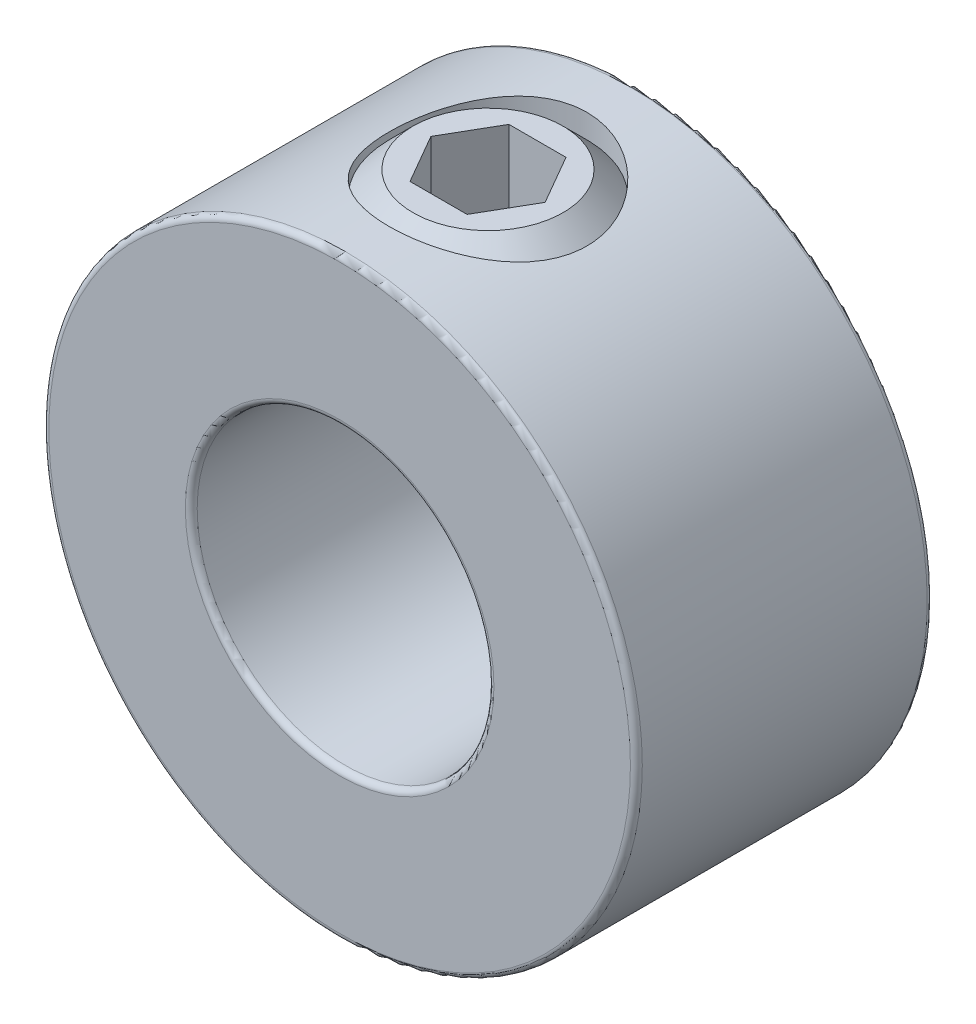
ISO-10303-21;
HEADER;
FILE_DESCRIPTION(('STEP AP214'),'2;1');
FILE_NAME('part.step','',(''),(''),'','','');
FILE_SCHEMA(('AUTOMOTIVE_DESIGN { 1 0 10303 214 1 1 1 1 }'));
ENDSEC;
DATA;
#1=APPLICATION_CONTEXT('core data for automotive mechanical design processes');
#2=APPLICATION_PROTOCOL_DEFINITION('international standard','automotive_design',2000,#1);
#3=PRODUCT_CONTEXT('',#1,'mechanical');
#4=PRODUCT('Part','Part','',(#3));
#5=PRODUCT_RELATED_PRODUCT_CATEGORY('part','',(#4));
#6=PRODUCT_DEFINITION_FORMATION('','',#4);
#7=PRODUCT_DEFINITION_CONTEXT('part definition',#1,'design');
#8=PRODUCT_DEFINITION('design','',#6,#7);
#9=PRODUCT_DEFINITION_SHAPE('','',#8);
#10=(LENGTH_UNIT() NAMED_UNIT(*) SI_UNIT(.MILLI.,.METRE.));
#11=(NAMED_UNIT(*) PLANE_ANGLE_UNIT() SI_UNIT($,.RADIAN.));
#12=(NAMED_UNIT(*) SI_UNIT($,.STERADIAN.) SOLID_ANGLE_UNIT());
#13=UNCERTAINTY_MEASURE_WITH_UNIT(LENGTH_MEASURE(1.E-05),#10,'distance_accuracy_value','');
#14=(GEOMETRIC_REPRESENTATION_CONTEXT(3) GLOBAL_UNCERTAINTY_ASSIGNED_CONTEXT((#13)) GLOBAL_UNIT_ASSIGNED_CONTEXT((#10,
#11,#12)) REPRESENTATION_CONTEXT('',''));
#15=CARTESIAN_POINT('',(0.,0.,0.));
#16=DIRECTION('',(0.,0.,1.));
#17=DIRECTION('',(1.,0.,0.));
#18=AXIS2_PLACEMENT_3D('',#15,#16,#17);
#19=CARTESIAN_POINT('',(0.,9.525,0.));
#20=DIRECTION('',(0.,1.,0.));
#21=DIRECTION('',(-1.,0.,0.));
#22=AXIS2_PLACEMENT_3D('',#19,#20,#21);
#23=PLANE('',#22);
#24=CARTESIAN_POINT('',(0.,9.525,0.));
#25=DIRECTION('',(0.,1.,0.));
#26=DIRECTION('',(-1.,0.,0.));
#27=AXIS2_PLACEMENT_3D('',#24,#25,#26);
#28=CIRCLE('',#27,2.40819263124403);
#29=CARTESIAN_POINT('',(-2.40819263124403,9.525,0.));
#30=VERTEX_POINT('',#29);
#31=EDGE_CURVE('E12',#30,#30,#28,.T.);
#32=ORIENTED_EDGE('',*,*,#31,.T.);
#33=EDGE_LOOP('',(#32));
#34=FACE_BOUND('',#33,.T.);
#35=DIRECTION('',(1.,0.,0.));
#36=VECTOR('',#35,1.);
#37=CARTESIAN_POINT('',(-0.91654355233853,9.52499999999999,-1.5875));
#38=LINE('',#37,#36);
#39=CARTESIAN_POINT('',(-0.91654355233853,9.52499999999999,-1.5875));
#40=VERTEX_POINT('',#39);
#41=CARTESIAN_POINT('',(0.916543552338532,9.525,-1.5875));
#42=VERTEX_POINT('',#41);
#43=EDGE_CURVE('E115',#40,#42,#38,.T.);
#44=ORIENTED_EDGE('',*,*,#43,.T.);
#45=DIRECTION('',(0.5,0.,0.866025403784439));
#46=VECTOR('',#45,1.);
#47=CARTESIAN_POINT('',(0.916543552338532,9.52499999999999,-1.5875));
#48=LINE('',#47,#46);
#49=CARTESIAN_POINT('',(1.83308710467706,9.52499999999999,0.));
#50=VERTEX_POINT('',#49);
#51=EDGE_CURVE('E61',#42,#50,#48,.T.);
#52=ORIENTED_EDGE('',*,*,#51,.T.);
#53=DIRECTION('',(-0.5,0.,0.866025403784439));
#54=VECTOR('',#53,1.);
#55=CARTESIAN_POINT('',(1.83308710467706,9.52499999999999,0.));
#56=LINE('',#55,#54);
#57=CARTESIAN_POINT('',(0.916543552338532,9.52499999999999,1.5875));
#58=VERTEX_POINT('',#57);
#59=EDGE_CURVE('E119',#50,#58,#56,.T.);
#60=ORIENTED_EDGE('',*,*,#59,.T.);
#61=DIRECTION('',(-1.,0.,0.));
#62=VECTOR('',#61,1.);
#63=CARTESIAN_POINT('',(0.916543552338532,9.52499999999999,1.5875));
#64=LINE('',#63,#62);
#65=CARTESIAN_POINT('',(-0.91654355233853,9.52499999999999,1.5875));
#66=VERTEX_POINT('',#65);
#67=EDGE_CURVE('E182',#58,#66,#64,.T.);
#68=ORIENTED_EDGE('',*,*,#67,.T.);
#69=DIRECTION('',(-0.5,0.,-0.866025403784438));
#70=VECTOR('',#69,1.);
#71=CARTESIAN_POINT('',(-0.91654355233853,9.52499999999999,1.5875));
#72=LINE('',#71,#70);
#73=CARTESIAN_POINT('',(-1.83308710467706,9.52499999999999,0.));
#74=VERTEX_POINT('',#73);
#75=EDGE_CURVE('E167',#66,#74,#72,.T.);
#76=ORIENTED_EDGE('',*,*,#75,.T.);
#77=DIRECTION('',(0.5,0.,-0.866025403784439));
#78=VECTOR('',#77,1.);
#79=CARTESIAN_POINT('',(-1.83308710467706,9.52499999999999,0.));
#80=LINE('',#79,#78);
#81=EDGE_CURVE('E163',#74,#40,#80,.T.);
#82=ORIENTED_EDGE('',*,*,#81,.T.);
#83=EDGE_LOOP('',(#44,#52,#60,#68,#76,#82));
#84=FACE_BOUND('',#83,.T.);
#85=ADVANCED_FACE('F47',(#34,#84),#23,.T.);
#86=CARTESIAN_POINT('',(0.,9.525,0.));
#87=DIRECTION('',(0.,-1.,0.));
#88=DIRECTION('',(1.,0.,0.));
#89=AXIS2_PLACEMENT_3D('',#86,#87,#88);
#90=CONICAL_SURFACE('',#89,2.40819263124403,0.785398163397448);
#91=CARTESIAN_POINT('',(0.,8.75819263124404,0.));
#92=DIRECTION('',(0.,1.,0.));
#93=DIRECTION('',(-1.,0.,0.));
#94=AXIS2_PLACEMENT_3D('',#91,#92,#93);
#95=CIRCLE('',#94,3.175);
#96=CARTESIAN_POINT('',(-3.175,8.75819263124404,0.));
#97=VERTEX_POINT('',#96);
#98=EDGE_CURVE('E54',#97,#97,#95,.T.);
#99=ORIENTED_EDGE('',*,*,#98,.T.);
#100=EDGE_LOOP('',(#99));
#101=FACE_BOUND('',#100,.T.);
#102=ORIENTED_EDGE('',*,*,#31,.F.);
#103=EDGE_LOOP('',(#102));
#104=FACE_BOUND('',#103,.T.);
#105=ADVANCED_FACE('F137',(#101,#104),#90,.T.);
#106=CARTESIAN_POINT('',(0.,4.7625,0.));
#107=DIRECTION('',(0.,1.,0.));
#108=DIRECTION('',(-1.,0.,0.));
#109=AXIS2_PLACEMENT_3D('',#106,#107,#108);
#110=CYLINDRICAL_SURFACE('',#109,3.175);
#111=CARTESIAN_POINT('',(0.,5.52930736875596,0.));
#112=DIRECTION('',(0.,1.,0.));
#113=DIRECTION('',(-1.,0.,0.));
#114=AXIS2_PLACEMENT_3D('',#111,#112,#113);
#115=CIRCLE('',#114,3.175);
#116=CARTESIAN_POINT('',(-3.175,5.52930736875596,0.));
#117=VERTEX_POINT('',#116);
#118=EDGE_CURVE('E132',#117,#117,#115,.T.);
#119=ORIENTED_EDGE('',*,*,#118,.T.);
#120=EDGE_LOOP('',(#119));
#121=FACE_BOUND('',#120,.T.);
#122=ORIENTED_EDGE('',*,*,#98,.F.);
#123=EDGE_LOOP('',(#122));
#124=FACE_BOUND('',#123,.T.);
#125=ADVANCED_FACE('F140',(#121,#124),#110,.T.);
#126=CARTESIAN_POINT('',(0.,5.52930736875596,0.));
#127=DIRECTION('',(0.,1.,0.));
#128=DIRECTION('',(-1.,0.,0.));
#129=AXIS2_PLACEMENT_3D('',#126,#127,#128);
#130=CONICAL_SURFACE('',#129,3.175,0.785398163397449);
#131=CARTESIAN_POINT('',(0.,4.7625,0.));
#132=DIRECTION('',(0.,1.,0.));
#133=DIRECTION('',(-1.,0.,0.));
#134=AXIS2_PLACEMENT_3D('',#131,#132,#133);
#135=CIRCLE('',#134,2.40819263124403);
#136=CARTESIAN_POINT('',(-2.40819263124403,4.7625,0.));
#137=VERTEX_POINT('',#136);
#138=EDGE_CURVE('E124',#137,#137,#135,.T.);
#139=ORIENTED_EDGE('',*,*,#138,.T.);
#140=EDGE_LOOP('',(#139));
#141=FACE_BOUND('',#140,.T.);
#142=ORIENTED_EDGE('',*,*,#118,.F.);
#143=EDGE_LOOP('',(#142));
#144=FACE_BOUND('',#143,.T.);
#145=ADVANCED_FACE('F142',(#141,#144),#130,.T.);
#146=CARTESIAN_POINT('',(-2.40819263124403,4.7625,0.));
#147=DIRECTION('',(0.,-1.,0.));
#148=DIRECTION('',(1.,0.,0.));
#149=AXIS2_PLACEMENT_3D('',#146,#147,#148);
#150=PLANE('',#149);
#151=CARTESIAN_POINT('',(0.,4.7625,0.));
#152=DIRECTION('',(0.,1.,0.));
#153=DIRECTION('',(-1.,0.,0.));
#154=AXIS2_PLACEMENT_3D('',#151,#152,#153);
#155=CIRCLE('',#154,0.920168842507157);
#156=CARTESIAN_POINT('',(-0.920168842507157,4.7625,0.));
#157=VERTEX_POINT('',#156);
#158=EDGE_CURVE('E120',#157,#157,#155,.T.);
#159=ORIENTED_EDGE('',*,*,#158,.T.);
#160=EDGE_LOOP('',(#159));
#161=FACE_BOUND('',#160,.T.);
#162=ORIENTED_EDGE('',*,*,#138,.F.);
#163=EDGE_LOOP('',(#162));
#164=FACE_BOUND('',#163,.T.);
#165=ADVANCED_FACE('F149',(#161,#164),#150,.T.);
#166=CARTESIAN_POINT('',(0.,4.7625,0.));
#167=DIRECTION('',(0.,-1.,0.));
#168=DIRECTION('',(1.,0.,0.));
#169=AXIS2_PLACEMENT_3D('',#166,#167,#168);
#170=CONICAL_SURFACE('',#169,0.920168842507157,0.785398163397448);
#171=CARTESIAN_POINT('',(0.,5.68266884250716,0.));
#172=VERTEX_POINT('',#171);
#173=VERTEX_LOOP('',#172);
#174=FACE_BOUND('',#173,.T.);
#175=ORIENTED_EDGE('',*,*,#158,.F.);
#176=EDGE_LOOP('',(#175));
#177=FACE_BOUND('',#176,.T.);
#178=ADVANCED_FACE('F216',(#174,#177),#170,.F.);
#179=CARTESIAN_POINT('',(0.916543552338532,6.34999999999999,-1.5875));
#180=DIRECTION('',(-0.866025403784438,0.,0.5));
#181=DIRECTION('',(0.5,0.,0.866025403784439));
#182=AXIS2_PLACEMENT_3D('',#179,#180,#181);
#183=PLANE('',#182);
#184=ORIENTED_EDGE('',*,*,#51,.F.);
#185=DIRECTION('',(0.,1.,0.));
#186=VECTOR('',#185,1.);
#187=CARTESIAN_POINT('',(0.916543552338532,6.34999999999999,-1.5875));
#188=LINE('',#187,#186);
#189=CARTESIAN_POINT('',(0.916543552338532,6.34999999999999,-1.5875));
#190=VERTEX_POINT('',#189);
#191=EDGE_CURVE('E114',#190,#42,#188,.T.);
#192=ORIENTED_EDGE('',*,*,#191,.F.);
#193=DIRECTION('',(0.5,0.,0.866025403784439));
#194=VECTOR('',#193,1.);
#195=CARTESIAN_POINT('',(0.916543552338532,6.34999999999999,-1.5875));
#196=LINE('',#195,#194);
#197=CARTESIAN_POINT('',(1.83308710467706,6.34999999999999,0.));
#198=VERTEX_POINT('',#197);
#199=EDGE_CURVE('E105',#190,#198,#196,.T.);
#200=ORIENTED_EDGE('',*,*,#199,.T.);
#201=DIRECTION('',(0.,1.,0.));
#202=VECTOR('',#201,1.);
#203=CARTESIAN_POINT('',(1.83308710467706,6.34999999999999,0.));
#204=LINE('',#203,#202);
#205=EDGE_CURVE('E113',#198,#50,#204,.T.);
#206=ORIENTED_EDGE('',*,*,#205,.T.);
#207=EDGE_LOOP('',(#184,#192,#200,#206));
#208=FACE_BOUND('',#207,.T.);
#209=ADVANCED_FACE('F112',(#208),#183,.T.);
#210=CARTESIAN_POINT('',(1.83308710467706,6.34999999999999,0.));
#211=DIRECTION('',(-0.866025403784439,0.,-0.5));
#212=DIRECTION('',(-0.5,0.,0.866025403784439));
#213=AXIS2_PLACEMENT_3D('',#210,#211,#212);
#214=PLANE('',#213);
#215=ORIENTED_EDGE('',*,*,#59,.F.);
#216=ORIENTED_EDGE('',*,*,#205,.F.);
#217=DIRECTION('',(-0.5,0.,0.866025403784439));
#218=VECTOR('',#217,1.);
#219=CARTESIAN_POINT('',(1.83308710467706,6.34999999999999,0.));
#220=LINE('',#219,#218);
#221=CARTESIAN_POINT('',(0.916543552338532,6.34999999999999,1.5875));
#222=VERTEX_POINT('',#221);
#223=EDGE_CURVE('E101',#198,#222,#220,.T.);
#224=ORIENTED_EDGE('',*,*,#223,.T.);
#225=DIRECTION('',(0.,1.,0.));
#226=VECTOR('',#225,1.);
#227=CARTESIAN_POINT('',(0.916543552338532,6.34999999999999,1.5875));
#228=LINE('',#227,#226);
#229=EDGE_CURVE('E121',#222,#58,#228,.T.);
#230=ORIENTED_EDGE('',*,*,#229,.T.);
#231=EDGE_LOOP('',(#215,#216,#224,#230));
#232=FACE_BOUND('',#231,.T.);
#233=ADVANCED_FACE('F117',(#232),#214,.T.);
#234=CARTESIAN_POINT('',(0.916543552338532,6.34999999999999,1.5875));
#235=DIRECTION('',(0.,0.,-1.));
#236=DIRECTION('',(-1.,0.,0.));
#237=AXIS2_PLACEMENT_3D('',#234,#235,#236);
#238=PLANE('',#237);
#239=ORIENTED_EDGE('',*,*,#67,.F.);
#240=ORIENTED_EDGE('',*,*,#229,.F.);
#241=DIRECTION('',(-1.,0.,0.));
#242=VECTOR('',#241,1.);
#243=CARTESIAN_POINT('',(0.916543552338532,6.34999999999999,1.5875));
#244=LINE('',#243,#242);
#245=CARTESIAN_POINT('',(-0.91654355233853,6.34999999999999,1.5875));
#246=VERTEX_POINT('',#245);
#247=EDGE_CURVE('E107',#222,#246,#244,.T.);
#248=ORIENTED_EDGE('',*,*,#247,.T.);
#249=DIRECTION('',(0.,1.,0.));
#250=VECTOR('',#249,1.);
#251=CARTESIAN_POINT('',(-0.91654355233853,6.34999999999999,1.5875));
#252=LINE('',#251,#250);
#253=EDGE_CURVE('E126',#246,#66,#252,.T.);
#254=ORIENTED_EDGE('',*,*,#253,.T.);
#255=EDGE_LOOP('',(#239,#240,#248,#254));
#256=FACE_BOUND('',#255,.T.);
#257=ADVANCED_FACE('F180',(#256),#238,.T.);
#258=CARTESIAN_POINT('',(-0.91654355233853,6.34999999999999,1.5875));
#259=DIRECTION('',(0.866025403784438,0.,-0.5));
#260=DIRECTION('',(-0.5,0.,-0.866025403784439));
#261=AXIS2_PLACEMENT_3D('',#258,#259,#260);
#262=PLANE('',#261);
#263=ORIENTED_EDGE('',*,*,#75,.F.);
#264=ORIENTED_EDGE('',*,*,#253,.F.);
#265=DIRECTION('',(-0.5,0.,-0.866025403784438));
#266=VECTOR('',#265,1.);
#267=CARTESIAN_POINT('',(-0.91654355233853,6.34999999999999,1.5875));
#268=LINE('',#267,#266);
#269=CARTESIAN_POINT('',(-1.83308710467706,6.34999999999999,0.));
#270=VERTEX_POINT('',#269);
#271=EDGE_CURVE('E193',#246,#270,#268,.T.);
#272=ORIENTED_EDGE('',*,*,#271,.T.);
#273=DIRECTION('',(0.,1.,0.));
#274=VECTOR('',#273,1.);
#275=CARTESIAN_POINT('',(-1.83308710467706,6.34999999999999,0.));
#276=LINE('',#275,#274);
#277=EDGE_CURVE('E175',#270,#74,#276,.T.);
#278=ORIENTED_EDGE('',*,*,#277,.T.);
#279=EDGE_LOOP('',(#263,#264,#272,#278));
#280=FACE_BOUND('',#279,.T.);
#281=ADVANCED_FACE('F184',(#280),#262,.T.);
#282=CARTESIAN_POINT('',(-1.83308710467706,6.34999999999999,0.));
#283=DIRECTION('',(0.866025403784439,0.,0.5));
#284=DIRECTION('',(0.5,0.,-0.866025403784439));
#285=AXIS2_PLACEMENT_3D('',#282,#283,#284);
#286=PLANE('',#285);
#287=ORIENTED_EDGE('',*,*,#81,.F.);
#288=ORIENTED_EDGE('',*,*,#277,.F.);
#289=DIRECTION('',(0.5,0.,-0.866025403784439));
#290=VECTOR('',#289,1.);
#291=CARTESIAN_POINT('',(-1.83308710467706,6.34999999999999,0.));
#292=LINE('',#291,#290);
#293=CARTESIAN_POINT('',(-0.91654355233853,6.34999999999999,-1.5875));
#294=VERTEX_POINT('',#293);
#295=EDGE_CURVE('E191',#270,#294,#292,.T.);
#296=ORIENTED_EDGE('',*,*,#295,.T.);
#297=DIRECTION('',(0.,1.,0.));
#298=VECTOR('',#297,1.);
#299=CARTESIAN_POINT('',(-0.91654355233853,6.34999999999999,-1.5875));
#300=LINE('',#299,#298);
#301=EDGE_CURVE('E172',#294,#40,#300,.T.);
#302=ORIENTED_EDGE('',*,*,#301,.T.);
#303=EDGE_LOOP('',(#287,#288,#296,#302));
#304=FACE_BOUND('',#303,.T.);
#305=ADVANCED_FACE('F197',(#304),#286,.T.);
#306=CARTESIAN_POINT('',(-0.91654355233853,6.34999999999999,-1.5875));
#307=DIRECTION('',(0.,0.,1.));
#308=DIRECTION('',(1.,0.,0.));
#309=AXIS2_PLACEMENT_3D('',#306,#307,#308);
#310=PLANE('',#309);
#311=ORIENTED_EDGE('',*,*,#43,.F.);
#312=ORIENTED_EDGE('',*,*,#301,.F.);
#313=DIRECTION('',(1.,0.,0.));
#314=VECTOR('',#313,1.);
#315=CARTESIAN_POINT('',(-0.91654355233853,6.34999999999999,-1.5875));
#316=LINE('',#315,#314);
#317=EDGE_CURVE('E173',#294,#190,#316,.T.);
#318=ORIENTED_EDGE('',*,*,#317,.T.);
#319=ORIENTED_EDGE('',*,*,#191,.T.);
#320=EDGE_LOOP('',(#311,#312,#318,#319));
#321=FACE_BOUND('',#320,.T.);
#322=ADVANCED_FACE('F198',(#321),#310,.T.);
#323=CARTESIAN_POINT('',(0.,6.34999999999999,-3.175));
#324=DIRECTION('',(0.,1.,0.));
#325=DIRECTION('',(0.,0.,1.));
#326=AXIS2_PLACEMENT_3D('',#323,#324,#325);
#327=PLANE('',#326);
#328=ORIENTED_EDGE('',*,*,#199,.F.);
#329=ORIENTED_EDGE('',*,*,#317,.F.);
#330=ORIENTED_EDGE('',*,*,#295,.F.);
#331=ORIENTED_EDGE('',*,*,#271,.F.);
#332=ORIENTED_EDGE('',*,*,#247,.F.);
#333=ORIENTED_EDGE('',*,*,#223,.F.);
#334=EDGE_LOOP('',(#328,#329,#330,#331,#332,#333));
#335=FACE_BOUND('',#334,.T.);
#336=ADVANCED_FACE('F103',(#335),#327,.T.);
#337=CLOSED_SHELL('',(#85,#105,#125,#145,#165,#178,#209,#233,#257,#281,#305,#322,#336));
#338=MANIFOLD_SOLID_BREP('B2',#337);
#339=CARTESIAN_POINT('',(0.,0.,4.7625));
#340=DIRECTION('',(0.,0.,1.));
#341=DIRECTION('',(1.,0.,0.));
#342=AXIS2_PLACEMENT_3D('',#339,#340,#341);
#343=PLANE('',#342);
#344=CARTESIAN_POINT('',(0.,0.,4.7625));
#345=DIRECTION('',(0.,0.,1.));
#346=DIRECTION('',(1.,0.,0.));
#347=AXIS2_PLACEMENT_3D('',#344,#345,#346);
#348=CIRCLE('',#347,4.953);
#349=CARTESIAN_POINT('',(4.953,0.,4.7625));
#350=VERTEX_POINT('',#349);
#351=EDGE_CURVE('E315',#350,#350,#348,.F.);
#352=ORIENTED_EDGE('',*,*,#351,.T.);
#353=EDGE_LOOP('',(#352));
#354=FACE_BOUND('',#353,.T.);
#355=CARTESIAN_POINT('',(0.,0.,4.7625));
#356=DIRECTION('',(0.,0.,1.));
#357=DIRECTION('',(1.,0.,0.));
#358=AXIS2_PLACEMENT_3D('',#355,#356,#357);
#359=CIRCLE('',#358,9.3345);
#360=CARTESIAN_POINT('',(9.3345,0.,4.7625));
#361=VERTEX_POINT('',#360);
#362=EDGE_CURVE('E319',#361,#361,#359,.T.);
#363=ORIENTED_EDGE('',*,*,#362,.T.);
#364=EDGE_LOOP('',(#363));
#365=FACE_BOUND('',#364,.T.);
#366=ADVANCED_FACE('F304',(#354,#365),#343,.T.);
#367=CARTESIAN_POINT('',(0.,0.,-4.7625));
#368=DIRECTION('',(0.,0.,1.));
#369=DIRECTION('',(1.,0.,0.));
#370=AXIS2_PLACEMENT_3D('',#367,#368,#369);
#371=PLANE('',#370);
#372=CARTESIAN_POINT('',(0.,0.,-4.7625));
#373=DIRECTION('',(0.,0.,1.));
#374=DIRECTION('',(1.,0.,0.));
#375=AXIS2_PLACEMENT_3D('',#372,#373,#374);
#376=CIRCLE('',#375,4.953);
#377=CARTESIAN_POINT('',(4.953,0.,-4.7625));
#378=VERTEX_POINT('',#377);
#379=EDGE_CURVE('E330',#378,#378,#376,.T.);
#380=ORIENTED_EDGE('',*,*,#379,.T.);
#381=EDGE_LOOP('',(#380));
#382=FACE_BOUND('',#381,.T.);
#383=CARTESIAN_POINT('',(0.,0.,-4.7625));
#384=DIRECTION('',(0.,0.,1.));
#385=DIRECTION('',(1.,0.,0.));
#386=AXIS2_PLACEMENT_3D('',#383,#384,#385);
#387=CIRCLE('',#386,9.3345);
#388=CARTESIAN_POINT('',(9.3345,0.,-4.7625));
#389=VERTEX_POINT('',#388);
#390=EDGE_CURVE('E333',#389,#389,#387,.F.);
#391=ORIENTED_EDGE('',*,*,#390,.T.);
#392=EDGE_LOOP('',(#391));
#393=FACE_BOUND('',#392,.T.);
#394=ADVANCED_FACE('F369',(#382,#393),#371,.F.);
#395=CARTESIAN_POINT('',(0.,0.,4.7625));
#396=DIRECTION('',(0.,0.,-1.));
#397=DIRECTION('',(-1.,0.,0.));
#398=AXIS2_PLACEMENT_3D('',#395,#396,#397);
#399=CYLINDRICAL_SURFACE('',#398,9.525);
#400=CARTESIAN_POINT('',(0.,0.,-4.572));
#401=DIRECTION('',(0.,0.,1.));
#402=DIRECTION('',(1.,0.,0.));
#403=AXIS2_PLACEMENT_3D('',#400,#401,#402);
#404=CIRCLE('',#403,9.525);
#405=CARTESIAN_POINT('',(9.525,0.,-4.572));
#406=VERTEX_POINT('',#405);
#407=EDGE_CURVE('E46',#406,#406,#404,.T.);
#408=ORIENTED_EDGE('',*,*,#407,.T.);
#409=EDGE_LOOP('',(#408));
#410=FACE_BOUND('',#409,.T.);
#411=CARTESIAN_POINT('',(0.,0.,4.572));
#412=DIRECTION('',(0.,0.,1.));
#413=DIRECTION('',(1.,0.,0.));
#414=AXIS2_PLACEMENT_3D('',#411,#412,#413);
#415=CIRCLE('',#414,9.525);
#416=CARTESIAN_POINT('',(9.525,0.,4.572));
#417=VERTEX_POINT('',#416);
#418=EDGE_CURVE('E311',#417,#417,#415,.F.);
#419=ORIENTED_EDGE('',*,*,#418,.T.);
#420=EDGE_LOOP('',(#419));
#421=FACE_BOUND('',#420,.T.);
#422=CARTESIAN_POINT('',(0.,9.525,-3.175));
#423=CARTESIAN_POINT('',(0.173238677165346,9.52500048580498,-3.17500080559796));
#424=CARTESIAN_POINT('',(0.346472492659896,9.52023018186455,-3.16077515504608));
#425=CARTESIAN_POINT('',(0.687837590771686,9.50167042395416,-3.10442257950533));
#426=CARTESIAN_POINT('',(0.855968341777246,9.48788003366834,-3.06229275796217));
#427=CARTESIAN_POINT('',(1.18215660666814,9.45277852602955,-2.95173640225564));
#428=CARTESIAN_POINT('',(1.34023044718816,9.43147998545459,-2.88335382669181));
#429=CARTESIAN_POINT('',(1.6426654243569,9.3835361515256,-2.72243177623824));
#430=CARTESIAN_POINT('',(1.78702384834389,9.35688980370195,-2.62988753611674));
#431=CARTESIAN_POINT('',(2.06292981819569,9.30002249856541,-2.41990306957346));
#432=CARTESIAN_POINT('',(2.19393674844713,9.26971591772517,-2.30177583122293));
#433=CARTESIAN_POINT('',(2.43469379932911,9.20941499436411,-2.04543928380665));
#434=CARTESIAN_POINT('',(2.54443923892904,9.17942072197493,-1.90722556410197));
#435=CARTESIAN_POINT('',(2.74264419157345,9.12219830615344,-1.60977225925124));
#436=CARTESIAN_POINT('',(2.83040092485178,9.0950744970031,-1.45004237635051));
#437=CARTESIAN_POINT('',(2.97757492456176,9.04796594704059,-1.11704090009411));
#438=CARTESIAN_POINT('',(3.03700083920298,9.02797902810367,-0.943773458008286));
#439=CARTESIAN_POINT('',(3.12379824029159,8.99830887880273,-0.594762521747942));
#440=CARTESIAN_POINT('',(3.15218269826287,8.98830104068516,-0.419299363047218));
#441=CARTESIAN_POINT('',(3.17925806658696,8.97876209798686,-0.065837580555076));
#442=CARTESIAN_POINT('',(3.17795815259498,8.97922775597168,0.112160242751682));
#443=CARTESIAN_POINT('',(3.14648819425835,8.99029872650972,0.45699880165977));
#444=CARTESIAN_POINT('',(3.11764017430521,9.00043970379417,0.623977679267887));
#445=CARTESIAN_POINT('',(3.0340495670469,9.02895888275449,0.950574107251702));
#446=CARTESIAN_POINT('',(2.97930387942919,9.04733807064542,1.11019077375635));
#447=CARTESIAN_POINT('',(2.84460650934117,9.09059367841715,1.42053547995295));
#448=CARTESIAN_POINT('',(2.76426310464556,9.11556996393148,1.57107898086575));
#449=CARTESIAN_POINT('',(2.58092291251247,9.16916373477931,1.85696513378813));
#450=CARTESIAN_POINT('',(2.47791958175572,9.19778227084722,1.99230337801349));
#451=CARTESIAN_POINT('',(2.2458341312661,9.25726270107577,2.25136582416045));
#452=CARTESIAN_POINT('',(2.11567125149229,9.28816371201626,2.3741148050663));
#453=CARTESIAN_POINT('',(1.83622813465495,9.34742029378842,2.59629677165629));
#454=CARTESIAN_POINT('',(1.68694606622308,9.37577562033364,2.69572752117228));
#455=CARTESIAN_POINT('',(1.3714336714219,9.42711817702495,2.86923575324634));
#456=CARTESIAN_POINT('',(1.20504990262187,9.45004936275525,2.94305193500683));
#457=CARTESIAN_POINT('',(0.861279339682312,9.4875530068358,3.06134507730938));
#458=CARTESIAN_POINT('',(0.683896391141978,9.50212836854242,3.10583222946942));
#459=CARTESIAN_POINT('',(0.33141865875554,9.52079715951823,3.16247673962099));
#460=CARTESIAN_POINT('',(0.156557979570887,9.52531755822087,3.17595189412349));
#461=CARTESIAN_POINT('',(-0.192960847123753,9.52464766056077,3.17394376132486));
#462=CARTESIAN_POINT('',(-0.36761902383989,9.51945900331475,3.15846536206389));
#463=CARTESIAN_POINT('',(-0.706500575516011,9.50023578476806,3.10003219293833));
#464=CARTESIAN_POINT('',(-0.870879661700627,9.48646180908036,3.05788629579286));
#465=CARTESIAN_POINT('',(-1.19016766849014,9.45171613685472,2.94832581381814));
#466=CARTESIAN_POINT('',(-1.34507537851482,9.43074352248193,2.88090800668978));
#467=CARTESIAN_POINT('',(-1.64556534104864,9.38304356837145,2.72075137890551));
#468=CARTESIAN_POINT('',(-1.79079512051444,9.35617936849621,2.62739316632593));
#469=CARTESIAN_POINT('',(-2.06395583568049,9.29974181184133,2.41873357370719));
#470=CARTESIAN_POINT('',(-2.19188146775096,9.27016762910402,2.30342549209915));
#471=CARTESIAN_POINT('',(-2.432851712285,9.20993992337912,2.04794246555408));
#472=CARTESIAN_POINT('',(-2.54495607735532,9.17929841452584,1.90687570450722));
#473=CARTESIAN_POINT('',(-2.74401763337735,9.121774152107,1.60727527220044));
#474=CARTESIAN_POINT('',(-2.83097461468097,9.09489142987857,1.44874145533681));
#475=CARTESIAN_POINT('',(-2.97687025407195,9.04819093937643,1.11863817645458));
#476=CARTESIAN_POINT('',(-3.03586556962394,9.02835890517708,0.947095898639171));
#477=CARTESIAN_POINT('',(-3.12386556696095,8.99829392572977,0.595697786109888));
#478=CARTESIAN_POINT('',(-3.15288375947876,8.98805665630055,0.415845734841193));
#479=CARTESIAN_POINT('',(-3.17905219686556,8.97883201925513,0.0628742200700937));
#480=CARTESIAN_POINT('',(-3.17776306695417,8.97929370817293,-0.110116430410661));
#481=CARTESIAN_POINT('',(-3.1471942816996,8.99005281690779,-0.453279112877545));
#482=CARTESIAN_POINT('',(-3.11791629228101,9.00034965132723,-0.623451312007403));
#483=CARTESIAN_POINT('',(-3.03330550668567,9.02920864668031,-0.952930730032847));
#484=CARTESIAN_POINT('',(-2.97847812359926,9.04761011221366,-1.11238291938927));
#485=CARTESIAN_POINT('',(-2.84473448628719,9.09054566248638,-1.419947017029));
#486=CARTESIAN_POINT('',(-2.76581288515833,9.11508110823773,-1.56805639902192));
#487=CARTESIAN_POINT('',(-2.58210269895239,9.16885482792697,-1.85573565200524));
#488=CARTESIAN_POINT('',(-2.47633567077754,9.19825159463785,-1.99465089352737));
#489=CARTESIAN_POINT('',(-2.24359115395568,9.25777156199328,-2.25326515749483));
#490=CARTESIAN_POINT('',(-2.11660766813345,9.28789496596782,-2.37295872780963));
#491=CARTESIAN_POINT('',(-1.83909194322319,9.34688346918603,-2.59443350901814));
#492=CARTESIAN_POINT('',(-1.68783480536164,9.3756537721899,-2.69533480410942));
#493=CARTESIAN_POINT('',(-1.36955960976604,9.42740021973043,-2.8701696116008));
#494=CARTESIAN_POINT('',(-1.20254559507021,9.45037784507677,-2.94411001830248));
#495=CARTESIAN_POINT('',(-0.865167329863099,9.4870751034262,-3.05981618315153));
#496=CARTESIAN_POINT('',(-0.695286130622597,9.50116249441509,-3.10287183038622));
#497=CARTESIAN_POINT('',(-0.350267320832534,9.52012342428904,-3.16045939114987));
#498=CARTESIAN_POINT('',(-0.175131176180769,9.52499950888798,-3.1749991856015));
#499=CARTESIAN_POINT('',(0.,9.525,-3.175));
#500=B_SPLINE_CURVE_WITH_KNOTS('',3,(#422,#423,#424,#425,#426,#427,#428,#429,#430,#431,#432,
#433,#434,#435,#436,#437,#438,#439,#440,#441,#442,#443,#444,#445,#446,#447,#448,#449,#450,#451,
#452,#453,#454,#455,#456,#457,#458,#459,#460,#461,#462,#463,#464,#465,#466,#467,#468,#469,#470,
#471,#472,#473,#474,#475,#476,#477,#478,#479,#480,#481,#482,#483,#484,#485,#486,#487,#488,#489,
#490,#491,#492,#493,#494,#495,#496,#497,#498,#499),.UNSPECIFIED.,.T.,.F.,(4,2,2,2,2,2,2,2,2,2,2,
2,2,2,2,2,2,2,2,2,2,2,2,2,2,2,2,2,2,2,2,2,2,2,2,2,2,2,4),(0.,0.519071561632585,1.03819701322438,
1.55645698636312,2.07481924951214,2.6093637259775,3.14402575687908,3.69406121814519,
4.24392866899746,4.77526114230342,5.30642937910266,5.81332424300314,6.32027980466155,
6.83539943417539,7.35066800622307,7.8928374595109,8.43505888444013,8.98265937939885,
9.53006948685136,10.0537512658116,10.5773446429626,11.0857715158083,11.5942632377703,
12.1161301950386,12.638156741095,13.1839024764639,13.7296527614611,14.274292439,
14.8186865394104,15.3351123975402,15.8515075194062,16.3580948898032,16.8647947620873,
17.3936046174648,17.92256420318,18.4721392315144,19.0215736265905,19.5464607283686,
20.0712027467109),.UNSPECIFIED.);
#501=CARTESIAN_POINT('',(0.,9.525,-3.175));
#502=VERTEX_POINT('',#501);
#503=EDGE_CURVE('E336',#502,#502,#500,.T.);
#504=ORIENTED_EDGE('',*,*,#503,.T.);
#505=EDGE_LOOP('',(#504));
#506=FACE_BOUND('',#505,.T.);
#507=ADVANCED_FACE('F365',(#410,#421,#506),#399,.T.);
#508=CARTESIAN_POINT('',(0.,0.,4.7625));
#509=DIRECTION('',(0.,0.,-1.));
#510=DIRECTION('',(-1.,0.,0.));
#511=AXIS2_PLACEMENT_3D('',#508,#509,#510);
#512=CYLINDRICAL_SURFACE('',#511,4.7625);
#513=CARTESIAN_POINT('',(0.,0.,-4.572));
#514=DIRECTION('',(0.,0.,1.));
#515=DIRECTION('',(1.,0.,0.));
#516=AXIS2_PLACEMENT_3D('',#513,#514,#515);
#517=CIRCLE('',#516,4.7625);
#518=CARTESIAN_POINT('',(4.7625,0.,-4.572));
#519=VERTEX_POINT('',#518);
#520=EDGE_CURVE('E324',#519,#519,#517,.F.);
#521=ORIENTED_EDGE('',*,*,#520,.T.);
#522=EDGE_LOOP('',(#521));
#523=FACE_BOUND('',#522,.T.);
#524=CARTESIAN_POINT('',(0.,0.,4.572));
#525=DIRECTION('',(0.,0.,1.));
#526=DIRECTION('',(1.,0.,0.));
#527=AXIS2_PLACEMENT_3D('',#524,#525,#526);
#528=CIRCLE('',#527,4.7625);
#529=CARTESIAN_POINT('',(4.7625,0.,4.572));
#530=VERTEX_POINT('',#529);
#531=EDGE_CURVE('E327',#530,#530,#528,.T.);
#532=ORIENTED_EDGE('',*,*,#531,.T.);
#533=EDGE_LOOP('',(#532));
#534=FACE_BOUND('',#533,.T.);
#535=CARTESIAN_POINT('',(0.,4.7625,-3.175));
#536=CARTESIAN_POINT('',(0.159513506146526,4.76249829558772,-3.17499785387674));
#537=CARTESIAN_POINT('',(0.319036822940597,4.75441585981929,-3.16291201378244));
#538=CARTESIAN_POINT('',(0.632990333269339,4.72288699141972,-3.1153157875296));
#539=CARTESIAN_POINT('',(0.787418072256468,4.6994332647002,-3.07979428046729));
#540=CARTESIAN_POINT('',(1.0861866118583,4.63947623936465,-2.98750378332687));
#541=CARTESIAN_POINT('',(1.23057094564588,4.60303407934685,-2.93083428235374));
#542=CARTESIAN_POINT('',(1.50719688917279,4.52002748417047,-2.79866196869855));
#543=CARTESIAN_POINT('',(1.63943673208792,4.47346157948094,-2.72315642160038));
#544=CARTESIAN_POINT('',(1.90068942785739,4.36923384005694,-2.54848209446027));
#545=CARTESIAN_POINT('',(2.0284762255929,4.31096574538352,-2.44784901636421));
#546=CARTESIAN_POINT('',(2.26651828028912,4.19071922389352,-2.22927855246795));
#547=CARTESIAN_POINT('',(2.37674794067855,4.12873555797057,-2.11131637522972));
#548=CARTESIAN_POINT('',(2.59432897361932,3.99618620055343,-1.83982936485523));
#549=CARTESIAN_POINT('',(2.69848308269039,3.92580920318787,-1.68363002512644));
#550=CARTESIAN_POINT('',(2.87893691841686,3.79546083955007,-1.35197313839848));
#551=CARTESIAN_POINT('',(2.95528481583058,3.73547157335729,-1.17654958761288));
#552=CARTESIAN_POINT('',(3.0587003056751,3.65087323287846,-0.862470821626492));
#553=CARTESIAN_POINT('',(3.09363184983488,3.62104984276855,-0.727823581043082));
#554=CARTESIAN_POINT('',(3.14564105737718,3.57597026836952,-0.452843098742185));
#555=CARTESIAN_POINT('',(3.16274949511548,3.56068897885195,-0.312520093909076));
#556=CARTESIAN_POINT('',(3.17803790572636,3.54705611398895,-0.0294087885536061));
#557=CARTESIAN_POINT('',(3.17614050629003,3.54877374048434,0.113387224758058));
#558=CARTESIAN_POINT('',(3.1533716036927,3.56901393593137,0.396295520403469));
#559=CARTESIAN_POINT('',(3.13248402562585,3.58755074204361,0.536405426371809));
#560=CARTESIAN_POINT('',(3.07443178311274,3.63739407712628,0.804016443958601));
#561=CARTESIAN_POINT('',(3.03802591942409,3.66810112544892,0.931801121179955));
#562=CARTESIAN_POINT('',(2.95068813219861,3.73871526235139,1.17955010979676));
#563=CARTESIAN_POINT('',(2.89975142875274,3.77862537744388,1.29951183185715));
#564=CARTESIAN_POINT('',(2.77294687249444,3.87293161809884,1.55420281498847));
#565=CARTESIAN_POINT('',(2.69411533030023,3.92862304429405,1.68697259197917));
#566=CARTESIAN_POINT('',(2.51886974692605,4.04322816135652,1.93894614005392));
#567=CARTESIAN_POINT('',(2.42243402035992,4.10214576296336,2.05813288170832));
#568=CARTESIAN_POINT('',(2.19045099950254,4.23137558230652,2.30591129113202));
#569=CARTESIAN_POINT('',(2.05095377025594,4.30140657245416,2.43099280228032));
#570=CARTESIAN_POINT('',(1.74943769853673,4.43258734804498,2.65619943508341));
#571=CARTESIAN_POINT('',(1.58744015020742,4.493745420159,2.75634790583761));
#572=CARTESIAN_POINT('',(1.2777118005163,4.59018328993748,2.91064587831312));
#573=CARTESIAN_POINT('',(1.13340775885306,4.62818577100373,2.96996383930038));
#574=CARTESIAN_POINT('',(0.835082219747426,4.69118503960837,3.06721656943046));
#575=CARTESIAN_POINT('',(0.681069057915083,4.71619281752454,3.10516941057244));
#576=CARTESIAN_POINT('',(0.366689406911032,4.75100462923954,3.15779334981527));
#577=CARTESIAN_POINT('',(0.206298501445472,4.76074299407139,3.17236389423949));
#578=CARTESIAN_POINT('',(-0.115000912030585,4.76381945007165,3.17697975309251));
#579=CARTESIAN_POINT('',(-0.27590938307122,4.75715868774695,3.16702678202589));
#580=CARTESIAN_POINT('',(-0.581748451061773,4.72915598211033,3.12479681179543));
#581=CARTESIAN_POINT('',(-0.727007443428387,4.70887816144478,3.09413703981371));
#582=CARTESIAN_POINT('',(-1.00983477297833,4.65643038239684,3.01371684845446));
#583=CARTESIAN_POINT('',(-1.14740187964354,4.62425852748368,2.963953382901));
#584=CARTESIAN_POINT('',(-1.42028029136544,4.54812959640013,2.84376447844169));
#585=CARTESIAN_POINT('',(-1.55495019310495,4.50357668840463,2.77227005539697));
#586=CARTESIAN_POINT('',(-1.81083430052963,4.40692945783369,2.61233715220837));
#587=CARTESIAN_POINT('',(-1.93204012275933,4.35483048266614,2.52388820764801));
#588=CARTESIAN_POINT('',(-2.17781894704302,4.23790342811906,2.31678500930826));
#589=CARTESIAN_POINT('',(-2.29989360271145,4.17236523918599,2.19556606216409));
#590=CARTESIAN_POINT('',(-2.52307674305786,4.04131737275621,1.93498560490976));
#591=CARTESIAN_POINT('',(-2.62417073664107,3.97580774594569,1.79561166279185));
#592=CARTESIAN_POINT('',(-2.79598082787364,3.85666740360083,1.51266141984501));
#593=CARTESIAN_POINT('',(-2.86854322403869,3.80250060257811,1.37043789728911));
#594=CARTESIAN_POINT('',(-2.99237739257787,3.70584371667973,1.07335216383611));
#595=CARTESIAN_POINT('',(-3.04368748566418,3.66333266217137,0.918513308918401));
#596=CARTESIAN_POINT('',(-3.11524401668582,3.60256467927562,0.627753877826356));
#597=CARTESIAN_POINT('',(-3.13941774208684,3.58132059145467,0.493439756093283));
#598=CARTESIAN_POINT('',(-3.17022488831674,3.55408653184003,0.221339911640261));
#599=CARTESIAN_POINT('',(-3.17687736084456,3.54807999179148,0.0835581242544777));
#600=CARTESIAN_POINT('',(-3.17220478264998,3.55225668535638,-0.191520836727938));
#601=CARTESIAN_POINT('',(-3.16086908702961,3.56244950530632,-0.328817675150234));
#602=CARTESIAN_POINT('',(-3.12097725174618,3.59744096141944,-0.599032910654162));
#603=CARTESIAN_POINT('',(-3.09239813794198,3.6222590824651,-0.731945216428473));
#604=CARTESIAN_POINT('',(-3.00978981561158,3.69136350740653,-1.02506622898968));
#605=CARTESIAN_POINT('',(-2.9510082914772,3.7390752101256,-1.18311132192876));
#606=CARTESIAN_POINT('',(-2.81121528101009,3.84527739400297,-1.48508652360585));
#607=CARTESIAN_POINT('',(-2.7301725841297,3.90378297026142,-1.6289964271167));
#608=CARTESIAN_POINT('',(-2.54632873237353,4.02617059026332,-1.90385549633636));
#609=CARTESIAN_POINT('',(-2.44315837250285,4.09013111420677,-2.03452106373605));
#610=CARTESIAN_POINT('',(-2.21726660759133,4.21685775015533,-2.27859138405742));
#611=CARTESIAN_POINT('',(-2.09453921249741,4.27962348959933,-2.39199082772431));
#612=CARTESIAN_POINT('',(-1.8873850660108,4.37333498138708,-2.55491858498312));
#613=CARTESIAN_POINT('',(-1.8090134436431,4.40641312548886,-2.61102761986732));
#614=CARTESIAN_POINT('',(-1.64665981934884,4.46961905722944,-2.71633779885705));
#615=CARTESIAN_POINT('',(-1.56268042207704,4.49974819878214,-2.76554211752335));
#616=CARTESIAN_POINT('',(-1.38960715113393,4.55616827072524,-2.85642356224378));
#617=CARTESIAN_POINT('',(-1.30051812806183,4.58246276002165,-2.89810767636216));
#618=CARTESIAN_POINT('',(-1.11782960098096,4.63042056995049,-2.97335672820606));
#619=CARTESIAN_POINT('',(-1.02423169482462,4.65208551661339,-3.00692451716838));
#620=CARTESIAN_POINT('',(-0.780235392827374,4.70058109652366,-3.08154139984118));
#621=CARTESIAN_POINT('',(-0.627104096318095,4.72362103868264,-3.11642765689178));
#622=CARTESIAN_POINT('',(-0.315982580686494,4.75457565287333,-3.16314936096945));
#623=CARTESIAN_POINT('',(-0.157996102785209,4.76250168819873,-3.17500212570784));
#624=CARTESIAN_POINT('',(0.,4.7625,-3.175));
#625=B_SPLINE_CURVE_WITH_KNOTS('',3,(#535,#536,#537,#538,#539,#540,#541,#542,#543,#544,#545,
#546,#547,#548,#549,#550,#551,#552,#553,#554,#555,#556,#557,#558,#559,#560,#561,#562,#563,#564,
#565,#566,#567,#568,#569,#570,#571,#572,#573,#574,#575,#576,#577,#578,#579,#580,#581,#582,#583,
#584,#585,#586,#587,#588,#589,#590,#591,#592,#593,#594,#595,#596,#597,#598,#599,#600,#601,#602,
#603,#604,#605,#606,#607,#608,#609,#610,#611,#612,#613,#614,#615,#616,#617,#618,#619,#620,#621,
#622,#623,#624),.UNSPECIFIED.,.T.,.F.,(4,2,2,2,2,2,2,2,2,2,2,2,2,2,2,2,2,2,2,2,2,2,2,2,2,2,2,2,
2,2,2,2,2,2,2,2,2,2,2,2,2,2,2,2,4),(0.,0.477921997077321,0.956070945278542,1.43199826818949,
1.90799472139476,2.42438283538384,2.94151703421856,3.54023109732372,4.13790297394634,
4.56300988710696,4.98738156455221,5.41348154879912,5.83994255655571,6.24758818745148,
6.6553680680092,7.14609274784494,7.63742604761198,8.23466340273952,8.8313393398877,
9.31106989228961,9.79039404549573,10.2717740223998,10.7531203456965,11.2006552211841,
11.6482614879236,12.1229810060221,12.5979944723587,13.1481222963466,13.6986288317687,
14.2025677230621,14.705593948025,15.1181442623597,15.5302458053914,15.9425913096208,
16.3554874162604,16.8784049132826,17.4020593249786,17.9352455177248,18.4685953331297,
18.7739424593009,19.0791487337135,19.3840699212457,19.6888838348845,20.1626158186784,
20.635991489477),.UNSPECIFIED.);
#626=CARTESIAN_POINT('',(0.,4.7625,-3.175));
#627=VERTEX_POINT('',#626);
#628=EDGE_CURVE('E337',#627,#627,#625,.T.);
#629=ORIENTED_EDGE('',*,*,#628,.F.);
#630=EDGE_LOOP('',(#629));
#631=FACE_BOUND('',#630,.T.);
#632=ADVANCED_FACE('F349',(#523,#534,#631),#512,.F.);
#633=CARTESIAN_POINT('',(0.,9.525,0.));
#634=DIRECTION('',(0.,-1.,0.));
#635=DIRECTION('',(0.,0.,-1.));
#636=AXIS2_PLACEMENT_3D('',#633,#634,#635);
#637=CYLINDRICAL_SURFACE('',#636,3.175);
#638=ORIENTED_EDGE('',*,*,#628,.T.);
#639=EDGE_LOOP('',(#638));
#640=FACE_BOUND('',#639,.T.);
#641=ORIENTED_EDGE('',*,*,#503,.F.);
#642=EDGE_LOOP('',(#641));
#643=FACE_BOUND('',#642,.T.);
#644=ADVANCED_FACE('F352',(#640,#643),#637,.F.);
#645=CARTESIAN_POINT('',(0.,0.,-4.572));
#646=DIRECTION('',(0.,0.,1.));
#647=DIRECTION('',(1.,0.,0.));
#648=AXIS2_PLACEMENT_3D('',#645,#646,#647);
#649=TOROIDAL_SURFACE('',#648,4.953,0.1905);
#650=ORIENTED_EDGE('',*,*,#520,.F.);
#651=EDGE_LOOP('',(#650));
#652=FACE_BOUND('',#651,.T.);
#653=ORIENTED_EDGE('',*,*,#379,.F.);
#654=EDGE_LOOP('',(#653));
#655=FACE_BOUND('',#654,.T.);
#656=ADVANCED_FACE('F355',(#652,#655),#649,.T.);
#657=CARTESIAN_POINT('',(0.,0.,4.572));
#658=DIRECTION('',(0.,0.,1.));
#659=DIRECTION('',(1.,0.,0.));
#660=AXIS2_PLACEMENT_3D('',#657,#658,#659);
#661=TOROIDAL_SURFACE('',#660,4.953,0.1905);
#662=ORIENTED_EDGE('',*,*,#351,.F.);
#663=EDGE_LOOP('',(#662));
#664=FACE_BOUND('',#663,.T.);
#665=ORIENTED_EDGE('',*,*,#531,.F.);
#666=EDGE_LOOP('',(#665));
#667=FACE_BOUND('',#666,.T.);
#668=ADVANCED_FACE('F362',(#664,#667),#661,.T.);
#669=CARTESIAN_POINT('',(0.,0.,-4.572));
#670=DIRECTION('',(0.,0.,1.));
#671=DIRECTION('',(1.,0.,0.));
#672=AXIS2_PLACEMENT_3D('',#669,#670,#671);
#673=TOROIDAL_SURFACE('',#672,9.3345,0.1905);
#674=ORIENTED_EDGE('',*,*,#390,.F.);
#675=EDGE_LOOP('',(#674));
#676=FACE_BOUND('',#675,.T.);
#677=ORIENTED_EDGE('',*,*,#407,.F.);
#678=EDGE_LOOP('',(#677));
#679=FACE_BOUND('',#678,.T.);
#680=ADVANCED_FACE('F381',(#676,#679),#673,.T.);
#681=CARTESIAN_POINT('',(0.,0.,4.572));
#682=DIRECTION('',(0.,0.,1.));
#683=DIRECTION('',(1.,0.,0.));
#684=AXIS2_PLACEMENT_3D('',#681,#682,#683);
#685=TOROIDAL_SURFACE('',#684,9.3345,0.1905);
#686=ORIENTED_EDGE('',*,*,#418,.F.);
#687=EDGE_LOOP('',(#686));
#688=FACE_BOUND('',#687,.T.);
#689=ORIENTED_EDGE('',*,*,#362,.F.);
#690=EDGE_LOOP('',(#689));
#691=FACE_BOUND('',#690,.T.);
#692=ADVANCED_FACE('F306',(#688,#691),#685,.T.);
#693=CLOSED_SHELL('',(#366,#394,#507,#632,#644,#656,#668,#680,#692));
#694=MANIFOLD_SOLID_BREP('B6',#693);
#695=ADVANCED_BREP_SHAPE_REPRESENTATION('',(#18,#338,#694),#14);
#696=SHAPE_DEFINITION_REPRESENTATION(#9,#695);
ENDSEC;
END-ISO-10303-21;
